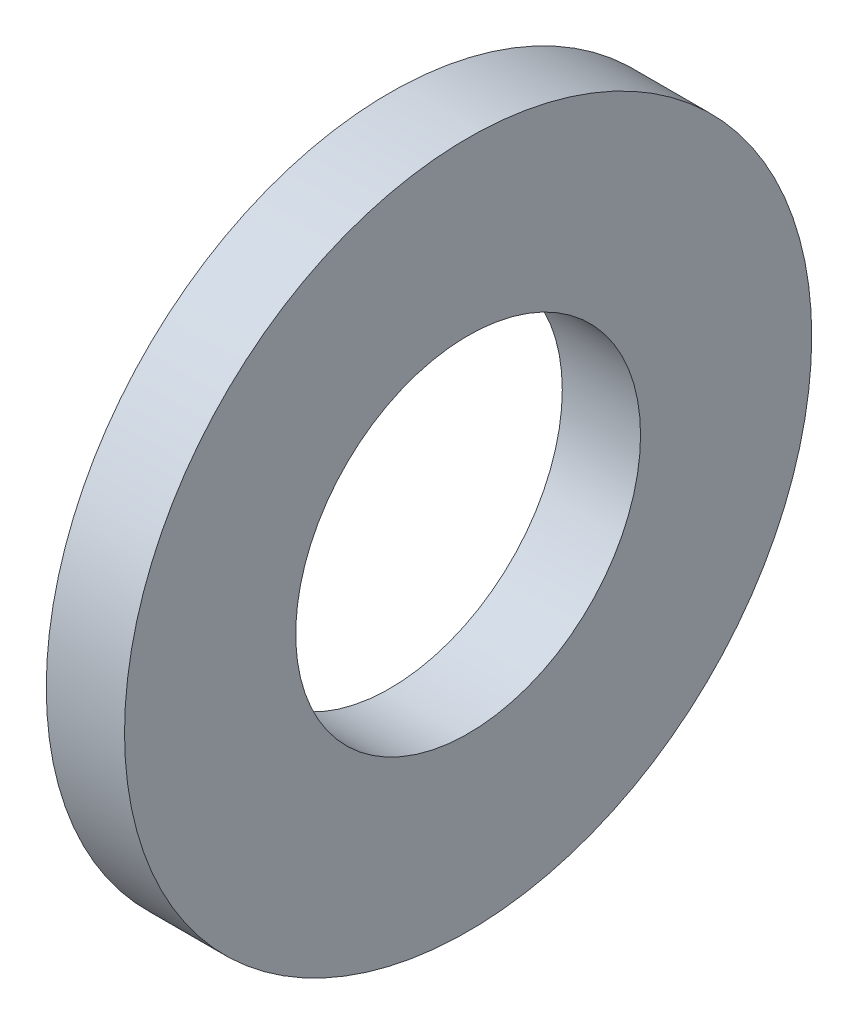
ISO-10303-21;
HEADER;
FILE_DESCRIPTION(('STEP AP214'),'2;1');
FILE_NAME('part.step','',(''),(''),'','','');
FILE_SCHEMA(('AUTOMOTIVE_DESIGN { 1 0 10303 214 1 1 1 1 }'));
ENDSEC;
DATA;
#1=APPLICATION_CONTEXT('core data for automotive mechanical design processes');
#2=APPLICATION_PROTOCOL_DEFINITION('international standard','automotive_design',2000,#1);
#3=PRODUCT_CONTEXT('',#1,'mechanical');
#4=PRODUCT('Part','Part','',(#3));
#5=PRODUCT_RELATED_PRODUCT_CATEGORY('part','',(#4));
#6=PRODUCT_DEFINITION_FORMATION('','',#4);
#7=PRODUCT_DEFINITION_CONTEXT('part definition',#1,'design');
#8=PRODUCT_DEFINITION('design','',#6,#7);
#9=PRODUCT_DEFINITION_SHAPE('','',#8);
#10=(LENGTH_UNIT() NAMED_UNIT(*) SI_UNIT(.MILLI.,.METRE.));
#11=(NAMED_UNIT(*) PLANE_ANGLE_UNIT() SI_UNIT($,.RADIAN.));
#12=(NAMED_UNIT(*) SI_UNIT($,.STERADIAN.) SOLID_ANGLE_UNIT());
#13=UNCERTAINTY_MEASURE_WITH_UNIT(LENGTH_MEASURE(1.E-05),#10,'distance_accuracy_value','');
#14=(GEOMETRIC_REPRESENTATION_CONTEXT(3) GLOBAL_UNCERTAINTY_ASSIGNED_CONTEXT((#13)) GLOBAL_UNIT_ASSIGNED_CONTEXT((#10,
#11,#12)) REPRESENTATION_CONTEXT('',''));
#15=CARTESIAN_POINT('',(0.,0.,0.));
#16=DIRECTION('',(0.,0.,1.));
#17=DIRECTION('',(1.,0.,0.));
#18=AXIS2_PLACEMENT_3D('',#15,#16,#17);
#19=CARTESIAN_POINT('',(0.8128,0.,0.));
#20=DIRECTION('',(-1.,0.,0.));
#21=DIRECTION('',(0.,0.,1.));
#22=AXIS2_PLACEMENT_3D('',#19,#20,#21);
#23=CYLINDRICAL_SURFACE('',#22,3.5687);
#24=CARTESIAN_POINT('',(0.,0.,0.));
#25=DIRECTION('',(-1.,0.,0.));
#26=DIRECTION('',(0.,0.,1.));
#27=AXIS2_PLACEMENT_3D('',#24,#25,#26);
#28=CIRCLE('',#27,3.5687);
#29=CARTESIAN_POINT('',(0.,0.,3.5687));
#30=VERTEX_POINT('',#29);
#31=EDGE_CURVE('E18',#30,#30,#28,.T.);
#32=ORIENTED_EDGE('',*,*,#31,.F.);
#33=EDGE_LOOP('',(#32));
#34=FACE_BOUND('',#33,.T.);
#35=CARTESIAN_POINT('',(0.8128,0.,0.));
#36=DIRECTION('',(-1.,0.,0.));
#37=DIRECTION('',(0.,0.,1.));
#38=AXIS2_PLACEMENT_3D('',#35,#36,#37);
#39=CIRCLE('',#38,3.5687);
#40=CARTESIAN_POINT('',(0.8128,0.,3.5687));
#41=VERTEX_POINT('',#40);
#42=EDGE_CURVE('E27',#41,#41,#39,.F.);
#43=ORIENTED_EDGE('',*,*,#42,.F.);
#44=EDGE_LOOP('',(#43));
#45=FACE_BOUND('',#44,.T.);
#46=ADVANCED_FACE('F14',(#34,#45),#23,.T.);
#47=CARTESIAN_POINT('',(0.,-3.640074,-3.640074));
#48=DIRECTION('',(-1.,0.,0.));
#49=DIRECTION('',(0.,0.,1.));
#50=AXIS2_PLACEMENT_3D('',#47,#48,#49);
#51=PLANE('',#50);
#52=CARTESIAN_POINT('',(0.,0.,0.));
#53=DIRECTION('',(1.,0.,0.));
#54=DIRECTION('',(0.,0.,-1.));
#55=AXIS2_PLACEMENT_3D('',#52,#53,#54);
#56=CIRCLE('',#55,1.7907);
#57=CARTESIAN_POINT('',(0.,0.,-1.7907));
#58=VERTEX_POINT('',#57);
#59=EDGE_CURVE('E22',#58,#58,#56,.F.);
#60=ORIENTED_EDGE('',*,*,#59,.F.);
#61=EDGE_LOOP('',(#60));
#62=FACE_BOUND('',#61,.T.);
#63=ORIENTED_EDGE('',*,*,#31,.T.);
#64=EDGE_LOOP('',(#63));
#65=FACE_BOUND('',#64,.T.);
#66=ADVANCED_FACE('F35',(#62,#65),#51,.T.);
#67=CARTESIAN_POINT('',(0.8128,-3.640074,3.640074));
#68=DIRECTION('',(1.,0.,0.));
#69=DIRECTION('',(0.,0.,-1.));
#70=AXIS2_PLACEMENT_3D('',#67,#68,#69);
#71=PLANE('',#70);
#72=CARTESIAN_POINT('',(0.8128,0.,0.));
#73=DIRECTION('',(1.,0.,0.));
#74=DIRECTION('',(0.,0.,-1.));
#75=AXIS2_PLACEMENT_3D('',#72,#73,#74);
#76=CIRCLE('',#75,1.7907);
#77=CARTESIAN_POINT('',(0.8128,0.,-1.7907));
#78=VERTEX_POINT('',#77);
#79=EDGE_CURVE('E10',#78,#78,#76,.T.);
#80=ORIENTED_EDGE('',*,*,#79,.F.);
#81=EDGE_LOOP('',(#80));
#82=FACE_BOUND('',#81,.T.);
#83=ORIENTED_EDGE('',*,*,#42,.T.);
#84=EDGE_LOOP('',(#83));
#85=FACE_BOUND('',#84,.T.);
#86=ADVANCED_FACE('F44',(#82,#85),#71,.T.);
#87=CARTESIAN_POINT('',(0.,0.,0.));
#88=DIRECTION('',(1.,0.,0.));
#89=DIRECTION('',(0.,0.,-1.));
#90=AXIS2_PLACEMENT_3D('',#87,#88,#89);
#91=CYLINDRICAL_SURFACE('',#90,1.7907);
#92=ORIENTED_EDGE('',*,*,#79,.T.);
#93=EDGE_LOOP('',(#92));
#94=FACE_BOUND('',#93,.T.);
#95=ORIENTED_EDGE('',*,*,#59,.T.);
#96=EDGE_LOOP('',(#95));
#97=FACE_BOUND('',#96,.T.);
#98=ADVANCED_FACE('F16',(#94,#97),#91,.F.);
#99=CLOSED_SHELL('',(#46,#66,#86,#98));
#100=MANIFOLD_SOLID_BREP('B1',#99);
#101=ADVANCED_BREP_SHAPE_REPRESENTATION('',(#18,#100),#14);
#102=SHAPE_DEFINITION_REPRESENTATION(#9,#101);
ENDSEC;
END-ISO-10303-21;
